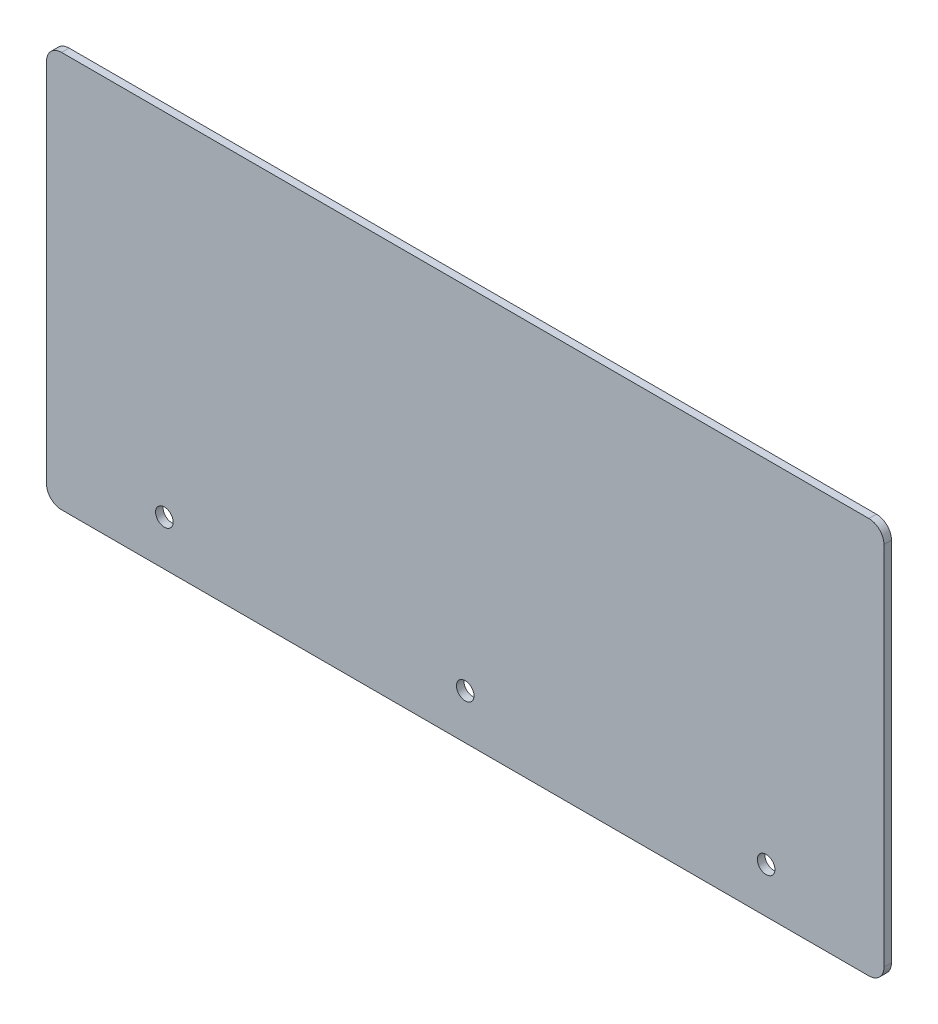
ISO-10303-21;
HEADER;
FILE_DESCRIPTION(('STEP AP214'),'2;1');
FILE_NAME('part.step','',(''),(''),'','','');
FILE_SCHEMA(('AUTOMOTIVE_DESIGN { 1 0 10303 214 1 1 1 1 }'));
ENDSEC;
DATA;
#1=APPLICATION_CONTEXT('core data for automotive mechanical design processes');
#2=APPLICATION_PROTOCOL_DEFINITION('international standard','automotive_design',2000,#1);
#3=PRODUCT_CONTEXT('',#1,'mechanical');
#4=PRODUCT('Part','Part','',(#3));
#5=PRODUCT_RELATED_PRODUCT_CATEGORY('part','',(#4));
#6=PRODUCT_DEFINITION_FORMATION('','',#4);
#7=PRODUCT_DEFINITION_CONTEXT('part definition',#1,'design');
#8=PRODUCT_DEFINITION('design','',#6,#7);
#9=PRODUCT_DEFINITION_SHAPE('','',#8);
#10=(LENGTH_UNIT() NAMED_UNIT(*) SI_UNIT(.MILLI.,.METRE.));
#11=(NAMED_UNIT(*) PLANE_ANGLE_UNIT() SI_UNIT($,.RADIAN.));
#12=(NAMED_UNIT(*) SI_UNIT($,.STERADIAN.) SOLID_ANGLE_UNIT());
#13=UNCERTAINTY_MEASURE_WITH_UNIT(LENGTH_MEASURE(1.E-05),#10,'distance_accuracy_value','');
#14=(GEOMETRIC_REPRESENTATION_CONTEXT(3) GLOBAL_UNCERTAINTY_ASSIGNED_CONTEXT((#13)) GLOBAL_UNIT_ASSIGNED_CONTEXT((#10,
#11,#12)) REPRESENTATION_CONTEXT('',''));
#15=CARTESIAN_POINT('',(0.,0.,0.));
#16=DIRECTION('',(0.,0.,1.));
#17=DIRECTION('',(1.,0.,0.));
#18=AXIS2_PLACEMENT_3D('',#15,#16,#17);
#19=CARTESIAN_POINT('',(0.,0.,1.5));
#20=DIRECTION('',(1.,0.,0.));
#21=DIRECTION('',(0.,0.,-1.));
#22=AXIS2_PLACEMENT_3D('',#19,#20,#21);
#23=PLANE('',#22);
#24=DIRECTION('',(0.,-1.,0.));
#25=VECTOR('',#24,1.);
#26=CARTESIAN_POINT('',(0.,0.,1.5));
#27=LINE('',#26,#25);
#28=CARTESIAN_POINT('',(0.,76.,1.5));
#29=VERTEX_POINT('',#28);
#30=CARTESIAN_POINT('',(0.,3.,1.5));
#31=VERTEX_POINT('',#30);
#32=EDGE_CURVE('E130',#29,#31,#27,.T.);
#33=ORIENTED_EDGE('',*,*,#32,.F.);
#34=DIRECTION('',(0.,0.,-1.));
#35=VECTOR('',#34,1.);
#36=CARTESIAN_POINT('',(0.,76.,1.5));
#37=LINE('',#36,#35);
#38=CARTESIAN_POINT('',(0.,76.,0.));
#39=VERTEX_POINT('',#38);
#40=EDGE_CURVE('E11',#29,#39,#37,.T.);
#41=ORIENTED_EDGE('',*,*,#40,.T.);
#42=DIRECTION('',(0.,-1.,0.));
#43=VECTOR('',#42,1.);
#44=CARTESIAN_POINT('',(0.,0.,0.));
#45=LINE('',#44,#43);
#46=CARTESIAN_POINT('',(0.,3.,0.));
#47=VERTEX_POINT('',#46);
#48=EDGE_CURVE('E132',#39,#47,#45,.T.);
#49=ORIENTED_EDGE('',*,*,#48,.T.);
#50=DIRECTION('',(0.,0.,-1.));
#51=VECTOR('',#50,1.);
#52=CARTESIAN_POINT('',(0.,3.,1.5));
#53=LINE('',#52,#51);
#54=EDGE_CURVE('E43',#47,#31,#53,.F.);
#55=ORIENTED_EDGE('',*,*,#54,.T.);
#56=EDGE_LOOP('',(#33,#41,#49,#55));
#57=FACE_BOUND('',#56,.T.);
#58=ADVANCED_FACE('F35',(#57),#23,.F.);
#59=CARTESIAN_POINT('',(0.,0.,1.5));
#60=DIRECTION('',(0.,1.,0.));
#61=DIRECTION('',(0.,0.,1.));
#62=AXIS2_PLACEMENT_3D('',#59,#60,#61);
#63=PLANE('',#62);
#64=DIRECTION('',(1.,0.,0.));
#65=VECTOR('',#64,1.);
#66=CARTESIAN_POINT('',(0.,0.,0.));
#67=LINE('',#66,#65);
#68=CARTESIAN_POINT('',(3.,0.,0.));
#69=VERTEX_POINT('',#68);
#70=CARTESIAN_POINT('',(164.,0.,0.));
#71=VERTEX_POINT('',#70);
#72=EDGE_CURVE('E128',#69,#71,#67,.T.);
#73=ORIENTED_EDGE('',*,*,#72,.T.);
#74=DIRECTION('',(0.,0.,-1.));
#75=VECTOR('',#74,1.);
#76=CARTESIAN_POINT('',(164.,0.,1.5));
#77=LINE('',#76,#75);
#78=CARTESIAN_POINT('',(164.,0.,1.5));
#79=VERTEX_POINT('',#78);
#80=EDGE_CURVE('E107',#71,#79,#77,.F.);
#81=ORIENTED_EDGE('',*,*,#80,.T.);
#82=DIRECTION('',(1.,0.,0.));
#83=VECTOR('',#82,1.);
#84=CARTESIAN_POINT('',(0.,0.,1.5));
#85=LINE('',#84,#83);
#86=CARTESIAN_POINT('',(3.,0.,1.5));
#87=VERTEX_POINT('',#86);
#88=EDGE_CURVE('E168',#87,#79,#85,.T.);
#89=ORIENTED_EDGE('',*,*,#88,.F.);
#90=DIRECTION('',(0.,0.,-1.));
#91=VECTOR('',#90,1.);
#92=CARTESIAN_POINT('',(3.,0.,1.5));
#93=LINE('',#92,#91);
#94=EDGE_CURVE('E112',#87,#69,#93,.T.);
#95=ORIENTED_EDGE('',*,*,#94,.T.);
#96=EDGE_LOOP('',(#73,#81,#89,#95));
#97=FACE_BOUND('',#96,.T.);
#98=ADVANCED_FACE('F172',(#97),#63,.F.);
#99=CARTESIAN_POINT('',(167.,0.,1.5));
#100=DIRECTION('',(-1.,0.,0.));
#101=DIRECTION('',(0.,0.,1.));
#102=AXIS2_PLACEMENT_3D('',#99,#100,#101);
#103=PLANE('',#102);
#104=DIRECTION('',(0.,1.,0.));
#105=VECTOR('',#104,1.);
#106=CARTESIAN_POINT('',(167.,0.,1.5));
#107=LINE('',#106,#105);
#108=CARTESIAN_POINT('',(167.,3.,1.5));
#109=VERTEX_POINT('',#108);
#110=CARTESIAN_POINT('',(167.,76.,1.5));
#111=VERTEX_POINT('',#110);
#112=EDGE_CURVE('E121',#109,#111,#107,.T.);
#113=ORIENTED_EDGE('',*,*,#112,.F.);
#114=DIRECTION('',(0.,0.,-1.));
#115=VECTOR('',#114,1.);
#116=CARTESIAN_POINT('',(167.,3.,1.5));
#117=LINE('',#116,#115);
#118=CARTESIAN_POINT('',(167.,3.,0.));
#119=VERTEX_POINT('',#118);
#120=EDGE_CURVE('E106',#109,#119,#117,.T.);
#121=ORIENTED_EDGE('',*,*,#120,.T.);
#122=DIRECTION('',(0.,1.,0.));
#123=VECTOR('',#122,1.);
#124=CARTESIAN_POINT('',(167.,0.,0.));
#125=LINE('',#124,#123);
#126=CARTESIAN_POINT('',(167.,76.,0.));
#127=VERTEX_POINT('',#126);
#128=EDGE_CURVE('E119',#119,#127,#125,.T.);
#129=ORIENTED_EDGE('',*,*,#128,.T.);
#130=DIRECTION('',(0.,0.,-1.));
#131=VECTOR('',#130,1.);
#132=CARTESIAN_POINT('',(167.,76.,1.5));
#133=LINE('',#132,#131);
#134=EDGE_CURVE('E123',#127,#111,#133,.F.);
#135=ORIENTED_EDGE('',*,*,#134,.T.);
#136=EDGE_LOOP('',(#113,#121,#129,#135));
#137=FACE_BOUND('',#136,.T.);
#138=ADVANCED_FACE('F118',(#137),#103,.F.);
#139=CARTESIAN_POINT('',(0.,79.,1.5));
#140=DIRECTION('',(0.,-1.,0.));
#141=DIRECTION('',(0.,0.,-1.));
#142=AXIS2_PLACEMENT_3D('',#139,#140,#141);
#143=PLANE('',#142);
#144=DIRECTION('',(-1.,0.,0.));
#145=VECTOR('',#144,1.);
#146=CARTESIAN_POINT('',(0.,79.,1.5));
#147=LINE('',#146,#145);
#148=CARTESIAN_POINT('',(164.,79.,1.5));
#149=VERTEX_POINT('',#148);
#150=CARTESIAN_POINT('',(3.,79.,1.5));
#151=VERTEX_POINT('',#150);
#152=EDGE_CURVE('E136',#149,#151,#147,.T.);
#153=ORIENTED_EDGE('',*,*,#152,.F.);
#154=DIRECTION('',(0.,0.,-1.));
#155=VECTOR('',#154,1.);
#156=CARTESIAN_POINT('',(164.,79.,1.5));
#157=LINE('',#156,#155);
#158=CARTESIAN_POINT('',(164.,79.,0.));
#159=VERTEX_POINT('',#158);
#160=EDGE_CURVE('E153',#149,#159,#157,.T.);
#161=ORIENTED_EDGE('',*,*,#160,.T.);
#162=DIRECTION('',(-1.,0.,0.));
#163=VECTOR('',#162,1.);
#164=CARTESIAN_POINT('',(0.,79.,0.));
#165=LINE('',#164,#163);
#166=CARTESIAN_POINT('',(3.,79.,0.));
#167=VERTEX_POINT('',#166);
#168=EDGE_CURVE('E127',#159,#167,#165,.T.);
#169=ORIENTED_EDGE('',*,*,#168,.T.);
#170=DIRECTION('',(0.,0.,-1.));
#171=VECTOR('',#170,1.);
#172=CARTESIAN_POINT('',(3.,79.,1.5));
#173=LINE('',#172,#171);
#174=EDGE_CURVE('E50',#167,#151,#173,.F.);
#175=ORIENTED_EDGE('',*,*,#174,.T.);
#176=EDGE_LOOP('',(#153,#161,#169,#175));
#177=FACE_BOUND('',#176,.T.);
#178=ADVANCED_FACE('F207',(#177),#143,.F.);
#179=CARTESIAN_POINT('',(0.,0.,1.5));
#180=DIRECTION('',(0.,0.,-1.));
#181=DIRECTION('',(-1.,0.,0.));
#182=AXIS2_PLACEMENT_3D('',#179,#180,#181);
#183=PLANE('',#182);
#184=CARTESIAN_POINT('',(83.5,9.,1.5));
#185=DIRECTION('',(0.,0.,-1.));
#186=DIRECTION('',(-1.,0.,0.));
#187=AXIS2_PLACEMENT_3D('',#184,#185,#186);
#188=CIRCLE('',#187,1.75);
#189=CARTESIAN_POINT('',(81.75,9.,1.5));
#190=VERTEX_POINT('',#189);
#191=EDGE_CURVE('E183',#190,#190,#188,.T.);
#192=ORIENTED_EDGE('',*,*,#191,.T.);
#193=EDGE_LOOP('',(#192));
#194=FACE_BOUND('',#193,.T.);
#195=CARTESIAN_POINT('',(143.5,9.00000000000003,1.5));
#196=DIRECTION('',(0.,0.,-1.));
#197=DIRECTION('',(-1.,0.,0.));
#198=AXIS2_PLACEMENT_3D('',#195,#196,#197);
#199=CIRCLE('',#198,1.74999999999998);
#200=CARTESIAN_POINT('',(141.75,9.00000000000003,1.5));
#201=VERTEX_POINT('',#200);
#202=EDGE_CURVE('E186',#201,#201,#199,.T.);
#203=ORIENTED_EDGE('',*,*,#202,.T.);
#204=EDGE_LOOP('',(#203));
#205=FACE_BOUND('',#204,.T.);
#206=CARTESIAN_POINT('',(23.5,9.,1.5));
#207=DIRECTION('',(0.,0.,-1.));
#208=DIRECTION('',(-1.,0.,0.));
#209=AXIS2_PLACEMENT_3D('',#206,#207,#208);
#210=CIRCLE('',#209,1.75);
#211=CARTESIAN_POINT('',(21.75,9.,1.5));
#212=VERTEX_POINT('',#211);
#213=EDGE_CURVE('E173',#212,#212,#210,.T.);
#214=ORIENTED_EDGE('',*,*,#213,.T.);
#215=EDGE_LOOP('',(#214));
#216=FACE_BOUND('',#215,.T.);
#217=ORIENTED_EDGE('',*,*,#88,.T.);
#218=CARTESIAN_POINT('',(164.,3.,1.5));
#219=DIRECTION('',(0.,0.,-1.));
#220=DIRECTION('',(-1.,0.,0.));
#221=AXIS2_PLACEMENT_3D('',#218,#219,#220);
#222=CIRCLE('',#221,3.);
#223=EDGE_CURVE('E150',#79,#109,#222,.F.);
#224=ORIENTED_EDGE('',*,*,#223,.T.);
#225=ORIENTED_EDGE('',*,*,#112,.T.);
#226=CARTESIAN_POINT('',(164.,76.,1.5));
#227=DIRECTION('',(0.,0.,-1.));
#228=DIRECTION('',(-1.,0.,0.));
#229=AXIS2_PLACEMENT_3D('',#226,#227,#228);
#230=CIRCLE('',#229,3.);
#231=EDGE_CURVE('E57',#111,#149,#230,.F.);
#232=ORIENTED_EDGE('',*,*,#231,.T.);
#233=ORIENTED_EDGE('',*,*,#152,.T.);
#234=CARTESIAN_POINT('',(3.,76.,1.5));
#235=DIRECTION('',(0.,0.,-1.));
#236=DIRECTION('',(-1.,0.,0.));
#237=AXIS2_PLACEMENT_3D('',#234,#235,#236);
#238=CIRCLE('',#237,3.);
#239=EDGE_CURVE('E147',#151,#29,#238,.F.);
#240=ORIENTED_EDGE('',*,*,#239,.T.);
#241=ORIENTED_EDGE('',*,*,#32,.T.);
#242=CARTESIAN_POINT('',(3.,3.,1.5));
#243=DIRECTION('',(0.,0.,-1.));
#244=DIRECTION('',(-1.,0.,0.));
#245=AXIS2_PLACEMENT_3D('',#242,#243,#244);
#246=CIRCLE('',#245,3.);
#247=EDGE_CURVE('E145',#31,#87,#246,.F.);
#248=ORIENTED_EDGE('',*,*,#247,.T.);
#249=EDGE_LOOP('',(#217,#224,#225,#232,#233,#240,#241,#248));
#250=FACE_BOUND('',#249,.T.);
#251=ADVANCED_FACE('F165',(#194,#205,#216,#250),#183,.F.);
#252=CARTESIAN_POINT('',(0.,0.,0.));
#253=DIRECTION('',(0.,0.,-1.));
#254=DIRECTION('',(-1.,0.,0.));
#255=AXIS2_PLACEMENT_3D('',#252,#253,#254);
#256=PLANE('',#255);
#257=CARTESIAN_POINT('',(83.5,9.,0.));
#258=DIRECTION('',(0.,0.,1.));
#259=DIRECTION('',(1.,0.,0.));
#260=AXIS2_PLACEMENT_3D('',#257,#258,#259);
#261=CIRCLE('',#260,1.75);
#262=CARTESIAN_POINT('',(85.25,9.,0.));
#263=VERTEX_POINT('',#262);
#264=EDGE_CURVE('E189',#263,#263,#261,.T.);
#265=ORIENTED_EDGE('',*,*,#264,.T.);
#266=EDGE_LOOP('',(#265));
#267=FACE_BOUND('',#266,.T.);
#268=CARTESIAN_POINT('',(143.5,9.00000000000003,0.));
#269=DIRECTION('',(0.,0.,1.));
#270=DIRECTION('',(-1.,0.,0.));
#271=AXIS2_PLACEMENT_3D('',#268,#269,#270);
#272=CIRCLE('',#271,1.74999999999998);
#273=CARTESIAN_POINT('',(141.75,9.00000000000003,0.));
#274=VERTEX_POINT('',#273);
#275=EDGE_CURVE('E190',#274,#274,#272,.T.);
#276=ORIENTED_EDGE('',*,*,#275,.T.);
#277=EDGE_LOOP('',(#276));
#278=FACE_BOUND('',#277,.T.);
#279=CARTESIAN_POINT('',(23.5,9.,0.));
#280=DIRECTION('',(0.,0.,1.));
#281=DIRECTION('',(1.,0.,0.));
#282=AXIS2_PLACEMENT_3D('',#279,#280,#281);
#283=CIRCLE('',#282,1.75);
#284=CARTESIAN_POINT('',(25.25,9.,0.));
#285=VERTEX_POINT('',#284);
#286=EDGE_CURVE('E175',#285,#285,#283,.T.);
#287=ORIENTED_EDGE('',*,*,#286,.T.);
#288=EDGE_LOOP('',(#287));
#289=FACE_BOUND('',#288,.T.);
#290=ORIENTED_EDGE('',*,*,#128,.F.);
#291=CARTESIAN_POINT('',(164.,3.,0.));
#292=DIRECTION('',(0.,0.,-1.));
#293=DIRECTION('',(-1.,0.,0.));
#294=AXIS2_PLACEMENT_3D('',#291,#292,#293);
#295=CIRCLE('',#294,3.);
#296=EDGE_CURVE('E102',#119,#71,#295,.T.);
#297=ORIENTED_EDGE('',*,*,#296,.T.);
#298=ORIENTED_EDGE('',*,*,#72,.F.);
#299=CARTESIAN_POINT('',(3.,3.,0.));
#300=DIRECTION('',(0.,0.,-1.));
#301=DIRECTION('',(-1.,0.,0.));
#302=AXIS2_PLACEMENT_3D('',#299,#300,#301);
#303=CIRCLE('',#302,3.);
#304=EDGE_CURVE('E122',#69,#47,#303,.T.);
#305=ORIENTED_EDGE('',*,*,#304,.T.);
#306=ORIENTED_EDGE('',*,*,#48,.F.);
#307=CARTESIAN_POINT('',(3.,76.,0.));
#308=DIRECTION('',(0.,0.,-1.));
#309=DIRECTION('',(-1.,0.,0.));
#310=AXIS2_PLACEMENT_3D('',#307,#308,#309);
#311=CIRCLE('',#310,3.);
#312=EDGE_CURVE('E139',#39,#167,#311,.T.);
#313=ORIENTED_EDGE('',*,*,#312,.T.);
#314=ORIENTED_EDGE('',*,*,#168,.F.);
#315=CARTESIAN_POINT('',(164.,76.,0.));
#316=DIRECTION('',(0.,0.,-1.));
#317=DIRECTION('',(-1.,0.,0.));
#318=AXIS2_PLACEMENT_3D('',#315,#316,#317);
#319=CIRCLE('',#318,3.);
#320=EDGE_CURVE('E113',#159,#127,#319,.T.);
#321=ORIENTED_EDGE('',*,*,#320,.T.);
#322=EDGE_LOOP('',(#290,#297,#298,#305,#306,#313,#314,#321));
#323=FACE_BOUND('',#322,.T.);
#324=ADVANCED_FACE('F125',(#267,#278,#289,#323),#256,.T.);
#325=CARTESIAN_POINT('',(164.,3.,1.5));
#326=DIRECTION('',(0.,0.,-1.));
#327=DIRECTION('',(-1.,0.,0.));
#328=AXIS2_PLACEMENT_3D('',#325,#326,#327);
#329=CYLINDRICAL_SURFACE('',#328,3.);
#330=ORIENTED_EDGE('',*,*,#223,.F.);
#331=ORIENTED_EDGE('',*,*,#80,.F.);
#332=ORIENTED_EDGE('',*,*,#296,.F.);
#333=ORIENTED_EDGE('',*,*,#120,.F.);
#334=EDGE_LOOP('',(#330,#331,#332,#333));
#335=FACE_BOUND('',#334,.T.);
#336=ADVANCED_FACE('F105',(#335),#329,.T.);
#337=CARTESIAN_POINT('',(164.,76.,1.5));
#338=DIRECTION('',(0.,0.,-1.));
#339=DIRECTION('',(-1.,0.,0.));
#340=AXIS2_PLACEMENT_3D('',#337,#338,#339);
#341=CYLINDRICAL_SURFACE('',#340,3.);
#342=ORIENTED_EDGE('',*,*,#231,.F.);
#343=ORIENTED_EDGE('',*,*,#134,.F.);
#344=ORIENTED_EDGE('',*,*,#320,.F.);
#345=ORIENTED_EDGE('',*,*,#160,.F.);
#346=EDGE_LOOP('',(#342,#343,#344,#345));
#347=FACE_BOUND('',#346,.T.);
#348=ADVANCED_FACE('F235',(#347),#341,.T.);
#349=CARTESIAN_POINT('',(3.,76.,1.5));
#350=DIRECTION('',(0.,0.,-1.));
#351=DIRECTION('',(-1.,0.,0.));
#352=AXIS2_PLACEMENT_3D('',#349,#350,#351);
#353=CYLINDRICAL_SURFACE('',#352,3.);
#354=ORIENTED_EDGE('',*,*,#239,.F.);
#355=ORIENTED_EDGE('',*,*,#174,.F.);
#356=ORIENTED_EDGE('',*,*,#312,.F.);
#357=ORIENTED_EDGE('',*,*,#40,.F.);
#358=EDGE_LOOP('',(#354,#355,#356,#357));
#359=FACE_BOUND('',#358,.T.);
#360=ADVANCED_FACE('F223',(#359),#353,.T.);
#361=CARTESIAN_POINT('',(3.,3.,1.5));
#362=DIRECTION('',(0.,0.,-1.));
#363=DIRECTION('',(-1.,0.,0.));
#364=AXIS2_PLACEMENT_3D('',#361,#362,#363);
#365=CYLINDRICAL_SURFACE('',#364,3.);
#366=ORIENTED_EDGE('',*,*,#247,.F.);
#367=ORIENTED_EDGE('',*,*,#54,.F.);
#368=ORIENTED_EDGE('',*,*,#304,.F.);
#369=ORIENTED_EDGE('',*,*,#94,.F.);
#370=EDGE_LOOP('',(#366,#367,#368,#369));
#371=FACE_BOUND('',#370,.T.);
#372=ADVANCED_FACE('F37',(#371),#365,.T.);
#373=CARTESIAN_POINT('',(23.5,9.,0.));
#374=DIRECTION('',(0.,0.,1.));
#375=DIRECTION('',(1.,0.,0.));
#376=AXIS2_PLACEMENT_3D('',#373,#374,#375);
#377=CYLINDRICAL_SURFACE('',#376,1.75);
#378=ORIENTED_EDGE('',*,*,#286,.F.);
#379=EDGE_LOOP('',(#378));
#380=FACE_BOUND('',#379,.T.);
#381=ORIENTED_EDGE('',*,*,#213,.F.);
#382=EDGE_LOOP('',(#381));
#383=FACE_BOUND('',#382,.T.);
#384=ADVANCED_FACE('F213',(#380,#383),#377,.F.);
#385=CARTESIAN_POINT('',(143.5,9.00000000000003,0.));
#386=DIRECTION('',(0.,0.,1.));
#387=DIRECTION('',(1.,0.,0.));
#388=AXIS2_PLACEMENT_3D('',#385,#386,#387);
#389=CYLINDRICAL_SURFACE('',#388,1.74999999999998);
#390=ORIENTED_EDGE('',*,*,#275,.F.);
#391=EDGE_LOOP('',(#390));
#392=FACE_BOUND('',#391,.T.);
#393=ORIENTED_EDGE('',*,*,#202,.F.);
#394=EDGE_LOOP('',(#393));
#395=FACE_BOUND('',#394,.T.);
#396=ADVANCED_FACE('F201',(#392,#395),#389,.F.);
#397=CARTESIAN_POINT('',(83.5,9.,0.));
#398=DIRECTION('',(0.,0.,1.));
#399=DIRECTION('',(1.,0.,0.));
#400=AXIS2_PLACEMENT_3D('',#397,#398,#399);
#401=CYLINDRICAL_SURFACE('',#400,1.75);
#402=ORIENTED_EDGE('',*,*,#264,.F.);
#403=EDGE_LOOP('',(#402));
#404=FACE_BOUND('',#403,.T.);
#405=ORIENTED_EDGE('',*,*,#191,.F.);
#406=EDGE_LOOP('',(#405));
#407=FACE_BOUND('',#406,.T.);
#408=ADVANCED_FACE('F198',(#404,#407),#401,.F.);
#409=CLOSED_SHELL('',(#58,#98,#138,#178,#251,#324,#336,#348,#360,#372,#384,#396,#408));
#410=MANIFOLD_SOLID_BREP('B2',#409);
#411=ADVANCED_BREP_SHAPE_REPRESENTATION('',(#18,#410),#14);
#412=SHAPE_DEFINITION_REPRESENTATION(#9,#411);
ENDSEC;
END-ISO-10303-21;
